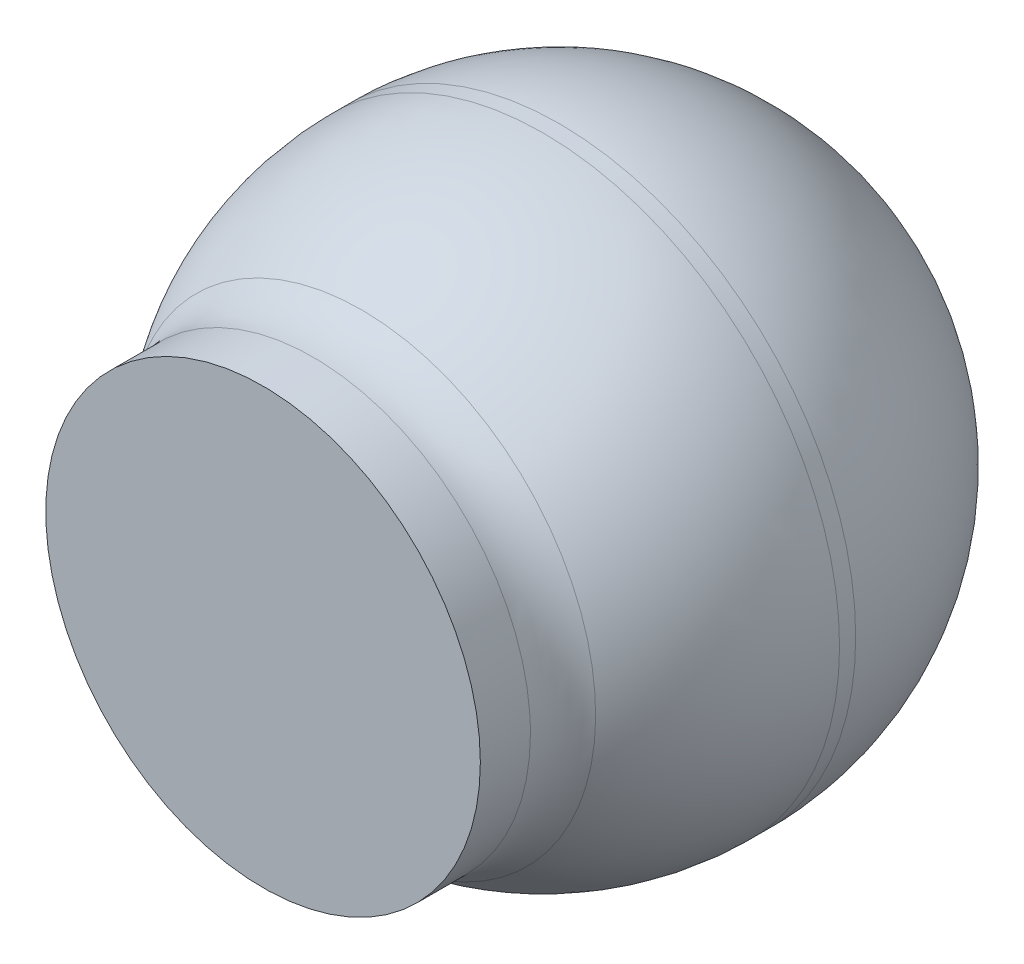
ISO-10303-21;
HEADER;
FILE_DESCRIPTION(('STEP AP214'),'2;1');
FILE_NAME('part.step','',(''),(''),'','','');
FILE_SCHEMA(('AUTOMOTIVE_DESIGN { 1 0 10303 214 1 1 1 1 }'));
ENDSEC;
DATA;
#1=APPLICATION_CONTEXT('core data for automotive mechanical design processes');
#2=APPLICATION_PROTOCOL_DEFINITION('international standard','automotive_design',2000,#1);
#3=PRODUCT_CONTEXT('',#1,'mechanical');
#4=PRODUCT('Part','Part','',(#3));
#5=PRODUCT_RELATED_PRODUCT_CATEGORY('part','',(#4));
#6=PRODUCT_DEFINITION_FORMATION('','',#4);
#7=PRODUCT_DEFINITION_CONTEXT('part definition',#1,'design');
#8=PRODUCT_DEFINITION('design','',#6,#7);
#9=PRODUCT_DEFINITION_SHAPE('','',#8);
#10=(LENGTH_UNIT() NAMED_UNIT(*) SI_UNIT(.MILLI.,.METRE.));
#11=(NAMED_UNIT(*) PLANE_ANGLE_UNIT() SI_UNIT($,.RADIAN.));
#12=(NAMED_UNIT(*) SI_UNIT($,.STERADIAN.) SOLID_ANGLE_UNIT());
#13=UNCERTAINTY_MEASURE_WITH_UNIT(LENGTH_MEASURE(1.E-05),#10,'distance_accuracy_value','');
#14=(GEOMETRIC_REPRESENTATION_CONTEXT(3) GLOBAL_UNCERTAINTY_ASSIGNED_CONTEXT((#13)) GLOBAL_UNIT_ASSIGNED_CONTEXT((#10,
#11,#12)) REPRESENTATION_CONTEXT('',''));
#15=CARTESIAN_POINT('',(0.,0.,0.));
#16=DIRECTION('',(0.,0.,1.));
#17=DIRECTION('',(1.,0.,0.));
#18=AXIS2_PLACEMENT_3D('',#15,#16,#17);
#19=CARTESIAN_POINT('',(-8.182919922269,-7.861349291452,10.006534503384));
#20=DIRECTION('',(0.,0.,-1.));
#21=DIRECTION('',(-1.,0.,0.));
#22=AXIS2_PLACEMENT_3D('',#19,#20,#21);
#23=PLANE('',#22);
#24=CARTESIAN_POINT('',(-8.182919922269,-7.861349291452,10.006534503384));
#25=DIRECTION('',(0.,0.,1.));
#26=DIRECTION('',(1.,0.,0.));
#27=AXIS2_PLACEMENT_3D('',#24,#25,#26);
#28=CIRCLE('',#27,0.275);
#29=CARTESIAN_POINT('',(-7.907919922269,-7.861349291452,10.006534503384));
#30=VERTEX_POINT('',#29);
#31=EDGE_CURVE('E20',#30,#30,#28,.F.);
#32=ORIENTED_EDGE('',*,*,#31,.F.);
#33=EDGE_LOOP('',(#32));
#34=FACE_BOUND('',#33,.T.);
#35=ADVANCED_FACE('F17',(#34),#23,.F.);
#36=CARTESIAN_POINT('',(-8.182919922269,-7.861349291452,9.906534503384));
#37=DIRECTION('',(0.,0.,1.));
#38=DIRECTION('',(1.,0.,0.));
#39=AXIS2_PLACEMENT_3D('',#36,#37,#38);
#40=CYLINDRICAL_SURFACE('',#39,0.275);
#41=CARTESIAN_POINT('',(-8.182919922269,-7.861349291452,9.943180457728));
#42=DIRECTION('',(0.,0.,-1.));
#43=DIRECTION('',(0.996700902337582,0.0811622527992467,0.));
#44=AXIS2_PLACEMENT_3D('',#41,#42,#43);
#45=CIRCLE('',#44,0.275000000000001);
#46=CARTESIAN_POINT('',(-7.90882717412616,-7.83902967193221,9.943180457728));
#47=VERTEX_POINT('',#46);
#48=EDGE_CURVE('E65',#47,#47,#45,.F.);
#49=ORIENTED_EDGE('',*,*,#48,.T.);
#50=EDGE_LOOP('',(#49));
#51=FACE_BOUND('',#50,.T.);
#52=ORIENTED_EDGE('',*,*,#31,.T.);
#53=EDGE_LOOP('',(#52));
#54=FACE_BOUND('',#53,.T.);
#55=ADVANCED_FACE('F62',(#51,#54),#40,.T.);
#56=CARTESIAN_POINT('',(-8.182919922269,-7.861349291452,9.943180457728));
#57=DIRECTION('',(0.,0.,-1.));
#58=DIRECTION('',(0.996700902337583,0.0811622527992448,0.));
#59=AXIS2_PLACEMENT_3D('',#56,#57,#58);
#60=TOROIDAL_SURFACE('',#59,0.375,0.1);
#61=ORIENTED_EDGE('',*,*,#48,.F.);
#62=EDGE_LOOP('',(#61));
#63=FACE_BOUND('',#62,.T.);
#64=CARTESIAN_POINT('',(-8.182919922269,-7.861349291452,9.881744931236));
#65=DIRECTION('',(0.,0.,-1.));
#66=DIRECTION('',(-0.996700902337597,-0.0811622527990627,0.));
#67=AXIS2_PLACEMENT_3D('',#64,#65,#66);
#68=CIRCLE('',#67,0.296097046412663);
#69=CARTESIAN_POINT('',(-8.478040115608,-7.885381194786,9.881744931236));
#70=VERTEX_POINT('',#69);
#71=EDGE_CURVE('E39',#70,#70,#68,.T.);
#72=ORIENTED_EDGE('',*,*,#71,.F.);
#73=EDGE_LOOP('',(#72));
#74=FACE_BOUND('',#73,.T.);
#75=ADVANCED_FACE('F57',(#63,#74),#60,.F.);
#76=CARTESIAN_POINT('',(-8.556682760645,-7.891785136252,9.651976062157));
#77=CARTESIAN_POINT('',(-8.556682760645,-7.891785136252,9.701461392103));
#78=CARTESIAN_POINT('',(-8.548526217348,-7.891120941579,9.750947004335));
#79=CARTESIAN_POINT('',(-8.532207085349,-7.889792059952,9.798626332798));
#80=CARTESIAN_POINT('',(-8.508341390838,-7.887848654938,9.842699544317));
#81=CARTESIAN_POINT('',(-8.478040115608,-7.885381194786,9.881744931236));
#82=(BOUNDED_CURVE() B_SPLINE_CURVE(5,(#76,#77,#78,#79,#80,#81),.UNSPECIFIED.,.F.,
.F.) B_SPLINE_CURVE_WITH_KNOTS((6,6),(0.,0.661568582165),
.UNSPECIFIED.) CURVE() GEOMETRIC_REPRESENTATION_ITEM() RATIONAL_B_SPLINE_CURVE((1.,1.,1.,1.,1.,1.)) REPRESENTATION_ITEM(''));
#83=CARTESIAN_POINT('',(-8.182919922269,-7.861349291452,9.651976062157));
#84=DIRECTION('',(0.,0.,-1.));
#85=AXIS1_PLACEMENT('',#83,#84);
#86=SURFACE_OF_REVOLUTION('',#82,#85);
#87=CARTESIAN_POINT('',(-8.182919922269,-7.861349291452,9.651976062157));
#88=DIRECTION('',(0.,0.,1.));
#89=DIRECTION('',(1.,0.,0.));
#90=AXIS2_PLACEMENT_3D('',#87,#88,#89);
#91=CIRCLE('',#90,0.375);
#92=CARTESIAN_POINT('',(-7.807919922269,-7.861349291452,9.651976062157));
#93=VERTEX_POINT('',#92);
#94=EDGE_CURVE('E36',#93,#93,#91,.F.);
#95=ORIENTED_EDGE('',*,*,#94,.F.);
#96=EDGE_LOOP('',(#95));
#97=FACE_BOUND('',#96,.T.);
#98=ORIENTED_EDGE('',*,*,#71,.T.);
#99=EDGE_LOOP('',(#98));
#100=FACE_BOUND('',#99,.T.);
#101=ADVANCED_FACE('F53',(#97,#100),#86,.F.);
#102=CARTESIAN_POINT('',(-8.182919922269,-7.861349291452,9.256534503384));
#103=DIRECTION('',(0.,0.,1.));
#104=DIRECTION('',(1.,0.,0.));
#105=AXIS2_PLACEMENT_3D('',#102,#103,#104);
#106=CYLINDRICAL_SURFACE('',#105,0.375);
#107=CARTESIAN_POINT('',(-8.182919922269,-7.861349291452,9.631534503384));
#108=DIRECTION('',(0.,0.,-1.));
#109=DIRECTION('',(0.0811622527992357,-0.996700902337583,0.));
#110=AXIS2_PLACEMENT_3D('',#107,#108,#109);
#111=CIRCLE('',#110,0.375);
#112=CARTESIAN_POINT('',(-8.15248407746929,-8.23511212982859,9.631534503384));
#113=VERTEX_POINT('',#112);
#114=CARTESIAN_POINT('',(-8.21335576706871,-7.48758645307541,9.631534503384));
#115=VERTEX_POINT('',#114);
#116=EDGE_CURVE('E11',#113,#115,#111,.T.);
#117=ORIENTED_EDGE('',*,*,#116,.F.);
#118=CARTESIAN_POINT('',(-8.182919922269,-7.861349291452,9.631534503384));
#119=DIRECTION('',(0.,0.,1.));
#120=DIRECTION('',(0.0811622527992365,-0.996700902337583,0.));
#121=AXIS2_PLACEMENT_3D('',#118,#119,#120);
#122=CIRCLE('',#121,0.375);
#123=EDGE_CURVE('E25',#115,#113,#122,.F.);
#124=ORIENTED_EDGE('',*,*,#123,.F.);
#125=EDGE_LOOP('',(#117,#124));
#126=FACE_BOUND('',#125,.T.);
#127=ORIENTED_EDGE('',*,*,#94,.T.);
#128=EDGE_LOOP('',(#127));
#129=FACE_BOUND('',#128,.T.);
#130=ADVANCED_FACE('F34',(#126,#129),#106,.T.);
#131=CARTESIAN_POINT('',(-8.182919922269,-7.861349291452,9.631534503384));
#132=DIRECTION('',(0.0811622527992361,-0.996700902337583,0.));
#133=DIRECTION('',(-0.996700902337583,-0.0811622527992361,0.));
#134=AXIS2_PLACEMENT_3D('',#131,#132,#133);
#135=SPHERICAL_SURFACE('',#134,0.375);
#136=ORIENTED_EDGE('',*,*,#123,.T.);
#137=ORIENTED_EDGE('',*,*,#116,.T.);
#138=EDGE_LOOP('',(#136,#137));
#139=FACE_BOUND('',#138,.T.);
#140=ADVANCED_FACE('F32',(#139),#135,.T.);
#141=CLOSED_SHELL('',(#35,#55,#75,#101,#130,#140));
#142=MANIFOLD_SOLID_BREP('B1',#141);
#143=ADVANCED_BREP_SHAPE_REPRESENTATION('',(#18,#142),#14);
#144=SHAPE_DEFINITION_REPRESENTATION(#9,#143);
ENDSEC;
END-ISO-10303-21;
